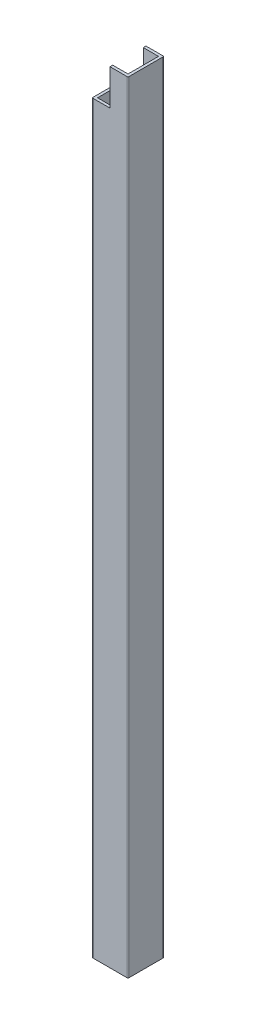
ISO-10303-21;
HEADER;
FILE_DESCRIPTION(('STEP AP214'),'2;1');
FILE_NAME('part.step','',(''),(''),'','','');
FILE_SCHEMA(('AUTOMOTIVE_DESIGN { 1 0 10303 214 1 1 1 1 }'));
ENDSEC;
DATA;
#1=APPLICATION_CONTEXT('core data for automotive mechanical design processes');
#2=APPLICATION_PROTOCOL_DEFINITION('international standard','automotive_design',2000,#1);
#3=PRODUCT_CONTEXT('',#1,'mechanical');
#4=PRODUCT('Part','Part','',(#3));
#5=PRODUCT_RELATED_PRODUCT_CATEGORY('part','',(#4));
#6=PRODUCT_DEFINITION_FORMATION('','',#4);
#7=PRODUCT_DEFINITION_CONTEXT('part definition',#1,'design');
#8=PRODUCT_DEFINITION('design','',#6,#7);
#9=PRODUCT_DEFINITION_SHAPE('','',#8);
#10=(LENGTH_UNIT() NAMED_UNIT(*) SI_UNIT(.MILLI.,.METRE.));
#11=(NAMED_UNIT(*) PLANE_ANGLE_UNIT() SI_UNIT($,.RADIAN.));
#12=(NAMED_UNIT(*) SI_UNIT($,.STERADIAN.) SOLID_ANGLE_UNIT());
#13=UNCERTAINTY_MEASURE_WITH_UNIT(LENGTH_MEASURE(1.E-05),#10,'distance_accuracy_value','');
#14=(GEOMETRIC_REPRESENTATION_CONTEXT(3) GLOBAL_UNCERTAINTY_ASSIGNED_CONTEXT((#13)) GLOBAL_UNIT_ASSIGNED_CONTEXT((#10,
#11,#12)) REPRESENTATION_CONTEXT('',''));
#15=CARTESIAN_POINT('',(0.,0.,0.));
#16=DIRECTION('',(0.,0.,1.));
#17=DIRECTION('',(1.,0.,0.));
#18=AXIS2_PLACEMENT_3D('',#15,#16,#17);
#19=CARTESIAN_POINT('',(0.5,1220.,-19.5));
#20=DIRECTION('',(0.,-1.,0.));
#21=DIRECTION('',(0.,0.,-1.));
#22=AXIS2_PLACEMENT_3D('',#19,#20,#21);
#23=CYLINDRICAL_SURFACE('',#22,0.5);
#24=DIRECTION('',(0.,-1.,0.));
#25=VECTOR('',#24,1.);
#26=CARTESIAN_POINT('',(0.5,1220.,-20.));
#27=LINE('',#26,#25);
#28=CARTESIAN_POINT('',(0.5,1115.,-20.));
#29=VERTEX_POINT('',#28);
#30=CARTESIAN_POINT('',(0.5,905.,-20.));
#31=VERTEX_POINT('',#30);
#32=EDGE_CURVE('E332',#29,#31,#27,.T.);
#33=ORIENTED_EDGE('',*,*,#32,.T.);
#34=CARTESIAN_POINT('',(0.5,905.,-19.5));
#35=DIRECTION('',(0.,1.,0.));
#36=DIRECTION('',(0.,0.,1.));
#37=AXIS2_PLACEMENT_3D('',#34,#35,#36);
#38=CIRCLE('',#37,0.5);
#39=CARTESIAN_POINT('',(0.,905.,-19.5));
#40=VERTEX_POINT('',#39);
#41=EDGE_CURVE('E469',#31,#40,#38,.T.);
#42=ORIENTED_EDGE('',*,*,#41,.T.);
#43=DIRECTION('',(0.,-1.,0.));
#44=VECTOR('',#43,1.);
#45=CARTESIAN_POINT('',(0.,1220.,-19.5));
#46=LINE('',#45,#44);
#47=CARTESIAN_POINT('',(0.,1115.,-19.5));
#48=VERTEX_POINT('',#47);
#49=EDGE_CURVE('E317',#48,#40,#46,.T.);
#50=ORIENTED_EDGE('',*,*,#49,.F.);
#51=CARTESIAN_POINT('',(0.5,1115.,-19.5));
#52=DIRECTION('',(0.,-1.,0.));
#53=DIRECTION('',(0.,0.,-1.));
#54=AXIS2_PLACEMENT_3D('',#51,#52,#53);
#55=CIRCLE('',#54,0.5);
#56=EDGE_CURVE('E543',#48,#29,#55,.T.);
#57=ORIENTED_EDGE('',*,*,#56,.T.);
#58=EDGE_LOOP('',(#33,#42,#50,#57));
#59=FACE_BOUND('',#58,.T.);
#60=ADVANCED_FACE('F39',(#59),#23,.T.);
#61=CARTESIAN_POINT('',(0.5,885.,-20.));
#62=VERTEX_POINT('',#61);
#63=CARTESIAN_POINT('',(0.5,785.,-20.));
#64=VERTEX_POINT('',#63);
#65=EDGE_CURVE('E326',#62,#64,#27,.T.);
#66=ORIENTED_EDGE('',*,*,#65,.T.);
#67=CARTESIAN_POINT('',(0.5,785.,-19.5));
#68=DIRECTION('',(0.,1.,0.));
#69=DIRECTION('',(0.,0.,1.));
#70=AXIS2_PLACEMENT_3D('',#67,#68,#69);
#71=CIRCLE('',#70,0.5);
#72=CARTESIAN_POINT('',(0.,785.,-19.5));
#73=VERTEX_POINT('',#72);
#74=EDGE_CURVE('E294',#64,#73,#71,.T.);
#75=ORIENTED_EDGE('',*,*,#74,.T.);
#76=CARTESIAN_POINT('',(0.,885.,-19.5));
#77=VERTEX_POINT('',#76);
#78=EDGE_CURVE('E305',#77,#73,#46,.T.);
#79=ORIENTED_EDGE('',*,*,#78,.F.);
#80=CARTESIAN_POINT('',(0.5,885.,-19.5));
#81=DIRECTION('',(0.,-1.,0.));
#82=DIRECTION('',(0.,0.,-1.));
#83=AXIS2_PLACEMENT_3D('',#80,#81,#82);
#84=CIRCLE('',#83,0.5);
#85=EDGE_CURVE('E456',#77,#62,#84,.T.);
#86=ORIENTED_EDGE('',*,*,#85,.T.);
#87=EDGE_LOOP('',(#66,#75,#79,#86));
#88=FACE_BOUND('',#87,.T.);
#89=ADVANCED_FACE('F701',(#88),#23,.T.);
#90=CARTESIAN_POINT('',(0.5,1200.,-19.9999999999999));
#91=VERTEX_POINT('',#90);
#92=CARTESIAN_POINT('',(0.5,1135.,-20.));
#93=VERTEX_POINT('',#92);
#94=EDGE_CURVE('E327',#91,#93,#27,.T.);
#95=ORIENTED_EDGE('',*,*,#94,.T.);
#96=CARTESIAN_POINT('',(0.5,1135.,-19.5));
#97=DIRECTION('',(0.,1.,0.));
#98=DIRECTION('',(0.,0.,1.));
#99=AXIS2_PLACEMENT_3D('',#96,#97,#98);
#100=CIRCLE('',#99,0.5);
#101=CARTESIAN_POINT('',(0.,1135.,-19.5));
#102=VERTEX_POINT('',#101);
#103=EDGE_CURVE('E557',#93,#102,#100,.T.);
#104=ORIENTED_EDGE('',*,*,#103,.T.);
#105=CARTESIAN_POINT('',(0.,1200.,-19.5));
#106=VERTEX_POINT('',#105);
#107=EDGE_CURVE('E319',#106,#102,#46,.T.);
#108=ORIENTED_EDGE('',*,*,#107,.F.);
#109=CARTESIAN_POINT('',(0.5,1200.,-19.5));
#110=DIRECTION('',(0.,1.,0.));
#111=DIRECTION('',(0.,0.,1.));
#112=AXIS2_PLACEMENT_3D('',#109,#110,#111);
#113=CIRCLE('',#112,0.5);
#114=EDGE_CURVE('E602',#91,#106,#113,.T.);
#115=ORIENTED_EDGE('',*,*,#114,.F.);
#116=EDGE_LOOP('',(#95,#104,#108,#115));
#117=FACE_BOUND('',#116,.T.);
#118=ADVANCED_FACE('F736',(#117),#23,.T.);
#119=CARTESIAN_POINT('',(0.5,1220.,-20.));
#120=DIRECTION('',(0.,0.,1.));
#121=DIRECTION('',(1.,0.,0.));
#122=AXIS2_PLACEMENT_3D('',#119,#120,#121);
#123=PLANE('',#122);
#124=DIRECTION('',(0.,-1.,0.));
#125=VECTOR('',#124,1.);
#126=CARTESIAN_POINT('',(19.5,1220.,-20.));
#127=LINE('',#126,#125);
#128=CARTESIAN_POINT('',(19.5,1220.,-20.));
#129=VERTEX_POINT('',#128);
#130=CARTESIAN_POINT('',(19.5,785.,-20.));
#131=VERTEX_POINT('',#130);
#132=EDGE_CURVE('E331',#129,#131,#127,.T.);
#133=ORIENTED_EDGE('',*,*,#132,.T.);
#134=DIRECTION('',(1.,0.,0.));
#135=VECTOR('',#134,1.);
#136=CARTESIAN_POINT('',(20.,785.,-20.));
#137=LINE('',#136,#135);
#138=EDGE_CURVE('E55',#64,#131,#137,.T.);
#139=ORIENTED_EDGE('',*,*,#138,.F.);
#140=ORIENTED_EDGE('',*,*,#65,.F.);
#141=DIRECTION('',(-1.,0.,0.));
#142=VECTOR('',#141,1.);
#143=CARTESIAN_POINT('',(15.,885.,-20.));
#144=LINE('',#143,#142);
#145=CARTESIAN_POINT('',(15.,885.,-20.));
#146=VERTEX_POINT('',#145);
#147=EDGE_CURVE('E410',#146,#62,#144,.T.);
#148=ORIENTED_EDGE('',*,*,#147,.F.);
#149=DIRECTION('',(0.,-1.,0.));
#150=VECTOR('',#149,1.);
#151=CARTESIAN_POINT('',(15.,905.,-20.));
#152=LINE('',#151,#150);
#153=CARTESIAN_POINT('',(15.,905.,-20.));
#154=VERTEX_POINT('',#153);
#155=EDGE_CURVE('E430',#154,#146,#152,.T.);
#156=ORIENTED_EDGE('',*,*,#155,.F.);
#157=DIRECTION('',(1.,0.,0.));
#158=VECTOR('',#157,1.);
#159=CARTESIAN_POINT('',(0.,905.,-20.));
#160=LINE('',#159,#158);
#161=EDGE_CURVE('E404',#31,#154,#160,.T.);
#162=ORIENTED_EDGE('',*,*,#161,.F.);
#163=ORIENTED_EDGE('',*,*,#32,.F.);
#164=DIRECTION('',(-1.,0.,0.));
#165=VECTOR('',#164,1.);
#166=CARTESIAN_POINT('',(15.,1115.,-20.));
#167=LINE('',#166,#165);
#168=CARTESIAN_POINT('',(15.,1115.,-20.));
#169=VERTEX_POINT('',#168);
#170=EDGE_CURVE('E514',#169,#29,#167,.T.);
#171=ORIENTED_EDGE('',*,*,#170,.F.);
#172=DIRECTION('',(0.,-1.,0.));
#173=VECTOR('',#172,1.);
#174=CARTESIAN_POINT('',(15.,1135.,-20.));
#175=LINE('',#174,#173);
#176=CARTESIAN_POINT('',(15.,1135.,-20.));
#177=VERTEX_POINT('',#176);
#178=EDGE_CURVE('E486',#177,#169,#175,.T.);
#179=ORIENTED_EDGE('',*,*,#178,.F.);
#180=DIRECTION('',(1.,0.,0.));
#181=VECTOR('',#180,1.);
#182=CARTESIAN_POINT('',(0.,1135.,-20.));
#183=LINE('',#182,#181);
#184=EDGE_CURVE('E491',#93,#177,#183,.T.);
#185=ORIENTED_EDGE('',*,*,#184,.F.);
#186=ORIENTED_EDGE('',*,*,#94,.F.);
#187=DIRECTION('',(-1.,0.,0.));
#188=VECTOR('',#187,1.);
#189=CARTESIAN_POINT('',(10.,1200.,-19.9999999999999));
#190=LINE('',#189,#188);
#191=CARTESIAN_POINT('',(10.,1200.,-19.9999999999999));
#192=VERTEX_POINT('',#191);
#193=EDGE_CURVE('E580',#192,#91,#190,.T.);
#194=ORIENTED_EDGE('',*,*,#193,.F.);
#195=DIRECTION('',(0.,1.,0.));
#196=VECTOR('',#195,1.);
#197=CARTESIAN_POINT('',(10.,1220.,-20.));
#198=LINE('',#197,#196);
#199=CARTESIAN_POINT('',(10.,1220.,-20.));
#200=VERTEX_POINT('',#199);
#201=EDGE_CURVE('E571',#192,#200,#198,.T.);
#202=ORIENTED_EDGE('',*,*,#201,.T.);
#203=DIRECTION('',(-1.,0.,0.));
#204=VECTOR('',#203,1.);
#205=CARTESIAN_POINT('',(0.5,1220.,-20.));
#206=LINE('',#205,#204);
#207=EDGE_CURVE('E644',#129,#200,#206,.T.);
#208=ORIENTED_EDGE('',*,*,#207,.F.);
#209=EDGE_LOOP('',(#133,#139,#140,#148,#156,#162,#163,#171,#179,#185,#186,#194,#202,#208));
#210=FACE_BOUND('',#209,.T.);
#211=ADVANCED_FACE('F704',(#210),#123,.F.);
#212=CARTESIAN_POINT('',(0.,1220.,-0.500000000000004));
#213=DIRECTION('',(1.,0.,0.));
#214=DIRECTION('',(0.,0.,-1.));
#215=AXIS2_PLACEMENT_3D('',#212,#213,#214);
#216=PLANE('',#215);
#217=ORIENTED_EDGE('',*,*,#78,.T.);
#218=DIRECTION('',(0.,0.,-1.));
#219=VECTOR('',#218,1.);
#220=CARTESIAN_POINT('',(0.,785.,0.));
#221=LINE('',#220,#219);
#222=CARTESIAN_POINT('',(0.,785.,-0.5));
#223=VERTEX_POINT('',#222);
#224=EDGE_CURVE('E285',#223,#73,#221,.T.);
#225=ORIENTED_EDGE('',*,*,#224,.F.);
#226=DIRECTION('',(0.,-1.,0.));
#227=VECTOR('',#226,1.);
#228=CARTESIAN_POINT('',(0.,1220.,-0.500000000000003));
#229=LINE('',#228,#227);
#230=CARTESIAN_POINT('',(0.,1200.,-0.5));
#231=VERTEX_POINT('',#230);
#232=EDGE_CURVE('E302',#231,#223,#229,.T.);
#233=ORIENTED_EDGE('',*,*,#232,.F.);
#234=DIRECTION('',(0.,0.,-1.));
#235=VECTOR('',#234,1.);
#236=CARTESIAN_POINT('',(0.,1200.,0.));
#237=LINE('',#236,#235);
#238=EDGE_CURVE('E561',#231,#106,#237,.T.);
#239=ORIENTED_EDGE('',*,*,#238,.T.);
#240=ORIENTED_EDGE('',*,*,#107,.T.);
#241=DIRECTION('',(0.,0.,-1.));
#242=VECTOR('',#241,1.);
#243=CARTESIAN_POINT('',(0.,1135.,-5.));
#244=LINE('',#243,#242);
#245=CARTESIAN_POINT('',(0.,1135.,-5.));
#246=VERTEX_POINT('',#245);
#247=EDGE_CURVE('E524',#246,#102,#244,.T.);
#248=ORIENTED_EDGE('',*,*,#247,.F.);
#249=DIRECTION('',(0.,1.,0.));
#250=VECTOR('',#249,1.);
#251=CARTESIAN_POINT('',(0.,1130.,-5.));
#252=LINE('',#251,#250);
#253=CARTESIAN_POINT('',(0.,1130.,-5.));
#254=VERTEX_POINT('',#253);
#255=EDGE_CURVE('E503',#254,#246,#252,.T.);
#256=ORIENTED_EDGE('',*,*,#255,.F.);
#257=DIRECTION('',(0.,0.,-1.));
#258=VECTOR('',#257,1.);
#259=CARTESIAN_POINT('',(0.,1130.,-5.));
#260=LINE('',#259,#258);
#261=CARTESIAN_POINT('',(0.,1130.,-17.));
#262=VERTEX_POINT('',#261);
#263=EDGE_CURVE('E527',#254,#262,#260,.T.);
#264=ORIENTED_EDGE('',*,*,#263,.T.);
#265=DIRECTION('',(0.,1.,0.));
#266=VECTOR('',#265,1.);
#267=CARTESIAN_POINT('',(0.,1130.,-17.));
#268=LINE('',#267,#266);
#269=CARTESIAN_POINT('',(0.,1120.,-17.));
#270=VERTEX_POINT('',#269);
#271=EDGE_CURVE('E473',#270,#262,#268,.T.);
#272=ORIENTED_EDGE('',*,*,#271,.F.);
#273=DIRECTION('',(0.,0.,-1.));
#274=VECTOR('',#273,1.);
#275=CARTESIAN_POINT('',(0.,1120.,-5.));
#276=LINE('',#275,#274);
#277=CARTESIAN_POINT('',(0.,1120.,-5.));
#278=VERTEX_POINT('',#277);
#279=EDGE_CURVE('E531',#278,#270,#276,.T.);
#280=ORIENTED_EDGE('',*,*,#279,.F.);
#281=DIRECTION('',(0.,1.,0.));
#282=VECTOR('',#281,1.);
#283=CARTESIAN_POINT('',(0.,1115.,-5.));
#284=LINE('',#283,#282);
#285=CARTESIAN_POINT('',(0.,1115.,-5.));
#286=VERTEX_POINT('',#285);
#287=EDGE_CURVE('E490',#286,#278,#284,.T.);
#288=ORIENTED_EDGE('',*,*,#287,.F.);
#289=DIRECTION('',(0.,0.,-1.));
#290=VECTOR('',#289,1.);
#291=CARTESIAN_POINT('',(0.,1115.,-5.));
#292=LINE('',#291,#290);
#293=EDGE_CURVE('E535',#286,#48,#292,.T.);
#294=ORIENTED_EDGE('',*,*,#293,.T.);
#295=ORIENTED_EDGE('',*,*,#49,.T.);
#296=DIRECTION('',(0.,0.,-1.));
#297=VECTOR('',#296,1.);
#298=CARTESIAN_POINT('',(0.,905.,-5.));
#299=LINE('',#298,#297);
#300=CARTESIAN_POINT('',(0.,905.,-5.));
#301=VERTEX_POINT('',#300);
#302=EDGE_CURVE('E439',#301,#40,#299,.T.);
#303=ORIENTED_EDGE('',*,*,#302,.F.);
#304=DIRECTION('',(0.,1.,0.));
#305=VECTOR('',#304,1.);
#306=CARTESIAN_POINT('',(0.,900.,-5.));
#307=LINE('',#306,#305);
#308=CARTESIAN_POINT('',(0.,900.,-5.));
#309=VERTEX_POINT('',#308);
#310=EDGE_CURVE('E422',#309,#301,#307,.T.);
#311=ORIENTED_EDGE('',*,*,#310,.F.);
#312=DIRECTION('',(0.,0.,-1.));
#313=VECTOR('',#312,1.);
#314=CARTESIAN_POINT('',(0.,900.,-5.));
#315=LINE('',#314,#313);
#316=CARTESIAN_POINT('',(0.,900.,-17.));
#317=VERTEX_POINT('',#316);
#318=EDGE_CURVE('E442',#309,#317,#315,.T.);
#319=ORIENTED_EDGE('',*,*,#318,.T.);
#320=DIRECTION('',(0.,1.,0.));
#321=VECTOR('',#320,1.);
#322=CARTESIAN_POINT('',(0.,900.,-17.));
#323=LINE('',#322,#321);
#324=CARTESIAN_POINT('',(0.,890.,-17.));
#325=VERTEX_POINT('',#324);
#326=EDGE_CURVE('E683',#325,#317,#323,.T.);
#327=ORIENTED_EDGE('',*,*,#326,.F.);
#328=DIRECTION('',(0.,0.,-1.));
#329=VECTOR('',#328,1.);
#330=CARTESIAN_POINT('',(0.,890.,-5.));
#331=LINE('',#330,#329);
#332=CARTESIAN_POINT('',(0.,890.,-5.));
#333=VERTEX_POINT('',#332);
#334=EDGE_CURVE('E446',#333,#325,#331,.T.);
#335=ORIENTED_EDGE('',*,*,#334,.F.);
#336=DIRECTION('',(0.,1.,0.));
#337=VECTOR('',#336,1.);
#338=CARTESIAN_POINT('',(0.,885.,-5.));
#339=LINE('',#338,#337);
#340=CARTESIAN_POINT('',(0.,885.,-5.));
#341=VERTEX_POINT('',#340);
#342=EDGE_CURVE('E403',#341,#333,#339,.T.);
#343=ORIENTED_EDGE('',*,*,#342,.F.);
#344=DIRECTION('',(0.,0.,-1.));
#345=VECTOR('',#344,1.);
#346=CARTESIAN_POINT('',(0.,885.,-5.));
#347=LINE('',#346,#345);
#348=EDGE_CURVE('E400',#341,#77,#347,.T.);
#349=ORIENTED_EDGE('',*,*,#348,.T.);
#350=EDGE_LOOP('',(#217,#225,#233,#239,#240,#248,#256,#264,#272,#280,#288,#294,#295,#303,#311,
#319,#327,#335,#343,#349));
#351=FACE_BOUND('',#350,.T.);
#352=ADVANCED_FACE('F300',(#351),#216,.F.);
#353=CARTESIAN_POINT('',(0.5,1220.,-0.5));
#354=DIRECTION('',(0.,-1.,0.));
#355=DIRECTION('',(0.,0.,-1.));
#356=AXIS2_PLACEMENT_3D('',#353,#354,#355);
#357=CYLINDRICAL_SURFACE('',#356,0.5);
#358=ORIENTED_EDGE('',*,*,#232,.T.);
#359=CARTESIAN_POINT('',(0.5,785.,-0.5));
#360=DIRECTION('',(0.,1.,0.));
#361=DIRECTION('',(0.,0.,1.));
#362=AXIS2_PLACEMENT_3D('',#359,#360,#361);
#363=CIRCLE('',#362,0.5);
#364=CARTESIAN_POINT('',(0.500000000000004,785.,0.));
#365=VERTEX_POINT('',#364);
#366=EDGE_CURVE('E282',#223,#365,#363,.T.);
#367=ORIENTED_EDGE('',*,*,#366,.T.);
#368=DIRECTION('',(0.,-1.,0.));
#369=VECTOR('',#368,1.);
#370=CARTESIAN_POINT('',(0.500000000000004,1220.,0.));
#371=LINE('',#370,#369);
#372=CARTESIAN_POINT('',(0.500000000000004,1200.,0.));
#373=VERTEX_POINT('',#372);
#374=EDGE_CURVE('E313',#373,#365,#371,.T.);
#375=ORIENTED_EDGE('',*,*,#374,.F.);
#376=CARTESIAN_POINT('',(0.5,1200.,-0.5));
#377=DIRECTION('',(0.,1.,0.));
#378=DIRECTION('',(0.,0.,1.));
#379=AXIS2_PLACEMENT_3D('',#376,#377,#378);
#380=CIRCLE('',#379,0.5);
#381=EDGE_CURVE('E311',#231,#373,#380,.T.);
#382=ORIENTED_EDGE('',*,*,#381,.F.);
#383=EDGE_LOOP('',(#358,#367,#375,#382));
#384=FACE_BOUND('',#383,.T.);
#385=ADVANCED_FACE('F310',(#384),#357,.T.);
#386=CARTESIAN_POINT('',(0.500000000000004,1220.,0.));
#387=DIRECTION('',(0.,0.,-1.));
#388=DIRECTION('',(-1.,0.,0.));
#389=AXIS2_PLACEMENT_3D('',#386,#387,#388);
#390=PLANE('',#389);
#391=ORIENTED_EDGE('',*,*,#374,.T.);
#392=DIRECTION('',(1.,0.,0.));
#393=VECTOR('',#392,1.);
#394=CARTESIAN_POINT('',(20.,785.,0.));
#395=LINE('',#394,#393);
#396=CARTESIAN_POINT('',(19.5,785.,0.));
#397=VERTEX_POINT('',#396);
#398=EDGE_CURVE('E288',#365,#397,#395,.T.);
#399=ORIENTED_EDGE('',*,*,#398,.T.);
#400=DIRECTION('',(0.,-1.,0.));
#401=VECTOR('',#400,1.);
#402=CARTESIAN_POINT('',(19.5,1220.,0.));
#403=LINE('',#402,#401);
#404=CARTESIAN_POINT('',(19.5,1220.,0.));
#405=VERTEX_POINT('',#404);
#406=EDGE_CURVE('E320',#405,#397,#403,.T.);
#407=ORIENTED_EDGE('',*,*,#406,.F.);
#408=DIRECTION('',(1.,0.,0.));
#409=VECTOR('',#408,1.);
#410=CARTESIAN_POINT('',(0.500000000000004,1220.,0.));
#411=LINE('',#410,#409);
#412=CARTESIAN_POINT('',(10.,1220.,0.));
#413=VERTEX_POINT('',#412);
#414=EDGE_CURVE('E648',#413,#405,#411,.T.);
#415=ORIENTED_EDGE('',*,*,#414,.F.);
#416=DIRECTION('',(0.,-1.,0.));
#417=VECTOR('',#416,1.);
#418=CARTESIAN_POINT('',(10.,1220.,0.));
#419=LINE('',#418,#417);
#420=CARTESIAN_POINT('',(10.,1200.,0.));
#421=VERTEX_POINT('',#420);
#422=EDGE_CURVE('E562',#413,#421,#419,.T.);
#423=ORIENTED_EDGE('',*,*,#422,.T.);
#424=DIRECTION('',(-1.,0.,0.));
#425=VECTOR('',#424,1.);
#426=CARTESIAN_POINT('',(10.,1200.,0.));
#427=LINE('',#426,#425);
#428=EDGE_CURVE('E585',#421,#373,#427,.T.);
#429=ORIENTED_EDGE('',*,*,#428,.T.);
#430=EDGE_LOOP('',(#391,#399,#407,#415,#423,#429));
#431=FACE_BOUND('',#430,.T.);
#432=ADVANCED_FACE('F659',(#431),#390,.F.);
#433=CARTESIAN_POINT('',(1.5,1220.,-1.5));
#434=DIRECTION('',(1.,0.,0.));
#435=DIRECTION('',(0.,0.,-1.));
#436=AXIS2_PLACEMENT_3D('',#433,#434,#435);
#437=PLANE('',#436);
#438=DIRECTION('',(0.,0.,1.));
#439=VECTOR('',#438,1.);
#440=CARTESIAN_POINT('',(1.5,785.,-1.5));
#441=LINE('',#440,#439);
#442=CARTESIAN_POINT('',(1.5,785.,-18.5));
#443=VERTEX_POINT('',#442);
#444=CARTESIAN_POINT('',(1.5,785.,-1.5));
#445=VERTEX_POINT('',#444);
#446=EDGE_CURVE('E673',#443,#445,#441,.T.);
#447=ORIENTED_EDGE('',*,*,#446,.F.);
#448=DIRECTION('',(0.,-1.,0.));
#449=VECTOR('',#448,1.);
#450=CARTESIAN_POINT('',(1.5,1220.,-18.5));
#451=LINE('',#450,#449);
#452=CARTESIAN_POINT('',(1.5,885.,-18.5));
#453=VERTEX_POINT('',#452);
#454=EDGE_CURVE('E616',#453,#443,#451,.T.);
#455=ORIENTED_EDGE('',*,*,#454,.F.);
#456=DIRECTION('',(0.,0.,-1.));
#457=VECTOR('',#456,1.);
#458=CARTESIAN_POINT('',(1.5,885.,-1.5));
#459=LINE('',#458,#457);
#460=CARTESIAN_POINT('',(1.5,885.,-5.));
#461=VERTEX_POINT('',#460);
#462=EDGE_CURVE('E388',#461,#453,#459,.T.);
#463=ORIENTED_EDGE('',*,*,#462,.F.);
#464=DIRECTION('',(0.,1.,0.));
#465=VECTOR('',#464,1.);
#466=CARTESIAN_POINT('',(1.5,1220.,-5.));
#467=LINE('',#466,#465);
#468=CARTESIAN_POINT('',(1.5,890.,-5.));
#469=VERTEX_POINT('',#468);
#470=EDGE_CURVE('E48',#461,#469,#467,.T.);
#471=ORIENTED_EDGE('',*,*,#470,.T.);
#472=DIRECTION('',(0.,0.,1.));
#473=VECTOR('',#472,1.);
#474=CARTESIAN_POINT('',(1.5,890.,-1.5));
#475=LINE('',#474,#473);
#476=CARTESIAN_POINT('',(1.5,890.,-17.));
#477=VERTEX_POINT('',#476);
#478=EDGE_CURVE('E386',#477,#469,#475,.T.);
#479=ORIENTED_EDGE('',*,*,#478,.F.);
#480=DIRECTION('',(0.,-1.,0.));
#481=VECTOR('',#480,1.);
#482=CARTESIAN_POINT('',(1.5,1220.,-17.));
#483=LINE('',#482,#481);
#484=CARTESIAN_POINT('',(1.5,900.,-17.));
#485=VERTEX_POINT('',#484);
#486=EDGE_CURVE('E413',#485,#477,#483,.T.);
#487=ORIENTED_EDGE('',*,*,#486,.F.);
#488=DIRECTION('',(0.,0.,-1.));
#489=VECTOR('',#488,1.);
#490=CARTESIAN_POINT('',(1.5,900.,-1.5));
#491=LINE('',#490,#489);
#492=CARTESIAN_POINT('',(1.5,900.,-5.));
#493=VERTEX_POINT('',#492);
#494=EDGE_CURVE('E462',#493,#485,#491,.T.);
#495=ORIENTED_EDGE('',*,*,#494,.F.);
#496=CARTESIAN_POINT('',(1.5,905.,-5.));
#497=VERTEX_POINT('',#496);
#498=EDGE_CURVE('E373',#493,#497,#467,.T.);
#499=ORIENTED_EDGE('',*,*,#498,.T.);
#500=DIRECTION('',(0.,0.,1.));
#501=VECTOR('',#500,1.);
#502=CARTESIAN_POINT('',(1.5,905.,-1.5));
#503=LINE('',#502,#501);
#504=CARTESIAN_POINT('',(1.5,905.,-18.5));
#505=VERTEX_POINT('',#504);
#506=EDGE_CURVE('E466',#505,#497,#503,.T.);
#507=ORIENTED_EDGE('',*,*,#506,.F.);
#508=CARTESIAN_POINT('',(1.5,1115.,-18.5));
#509=VERTEX_POINT('',#508);
#510=EDGE_CURVE('E622',#509,#505,#451,.T.);
#511=ORIENTED_EDGE('',*,*,#510,.F.);
#512=DIRECTION('',(0.,0.,-1.));
#513=VECTOR('',#512,1.);
#514=CARTESIAN_POINT('',(1.5,1115.,-1.5));
#515=LINE('',#514,#513);
#516=CARTESIAN_POINT('',(1.5,1115.,-5.));
#517=VERTEX_POINT('',#516);
#518=EDGE_CURVE('E523',#517,#509,#515,.T.);
#519=ORIENTED_EDGE('',*,*,#518,.F.);
#520=DIRECTION('',(0.,1.,0.));
#521=VECTOR('',#520,1.);
#522=CARTESIAN_POINT('',(1.5,1220.,-5.));
#523=LINE('',#522,#521);
#524=CARTESIAN_POINT('',(1.5,1120.,-5.));
#525=VERTEX_POINT('',#524);
#526=EDGE_CURVE('E364',#517,#525,#523,.T.);
#527=ORIENTED_EDGE('',*,*,#526,.T.);
#528=DIRECTION('',(0.,0.,1.));
#529=VECTOR('',#528,1.);
#530=CARTESIAN_POINT('',(1.5,1120.,-1.5));
#531=LINE('',#530,#529);
#532=CARTESIAN_POINT('',(1.5,1120.,-17.));
#533=VERTEX_POINT('',#532);
#534=EDGE_CURVE('E547',#533,#525,#531,.T.);
#535=ORIENTED_EDGE('',*,*,#534,.F.);
#536=DIRECTION('',(0.,-1.,0.));
#537=VECTOR('',#536,1.);
#538=CARTESIAN_POINT('',(1.5,1220.,-17.));
#539=LINE('',#538,#537);
#540=CARTESIAN_POINT('',(1.5,1130.,-17.));
#541=VERTEX_POINT('',#540);
#542=EDGE_CURVE('E481',#541,#533,#539,.T.);
#543=ORIENTED_EDGE('',*,*,#542,.F.);
#544=DIRECTION('',(0.,0.,-1.));
#545=VECTOR('',#544,1.);
#546=CARTESIAN_POINT('',(1.5,1130.,-1.5));
#547=LINE('',#546,#545);
#548=CARTESIAN_POINT('',(1.5,1130.,-5.));
#549=VERTEX_POINT('',#548);
#550=EDGE_CURVE('E550',#549,#541,#547,.T.);
#551=ORIENTED_EDGE('',*,*,#550,.F.);
#552=CARTESIAN_POINT('',(1.5,1135.,-5.));
#553=VERTEX_POINT('',#552);
#554=EDGE_CURVE('E360',#549,#553,#523,.T.);
#555=ORIENTED_EDGE('',*,*,#554,.T.);
#556=DIRECTION('',(0.,0.,1.));
#557=VECTOR('',#556,1.);
#558=CARTESIAN_POINT('',(1.5,1135.,-1.5));
#559=LINE('',#558,#557);
#560=CARTESIAN_POINT('',(1.5,1135.,-18.5));
#561=VERTEX_POINT('',#560);
#562=EDGE_CURVE('E554',#561,#553,#559,.T.);
#563=ORIENTED_EDGE('',*,*,#562,.F.);
#564=CARTESIAN_POINT('',(1.5,1200.,-18.5));
#565=VERTEX_POINT('',#564);
#566=EDGE_CURVE('E617',#565,#561,#451,.T.);
#567=ORIENTED_EDGE('',*,*,#566,.F.);
#568=DIRECTION('',(0.,0.,1.));
#569=VECTOR('',#568,1.);
#570=CARTESIAN_POINT('',(1.5,1200.,-1.5));
#571=LINE('',#570,#569);
#572=CARTESIAN_POINT('',(1.5,1200.,-1.5));
#573=VERTEX_POINT('',#572);
#574=EDGE_CURVE('E592',#565,#573,#571,.T.);
#575=ORIENTED_EDGE('',*,*,#574,.T.);
#576=DIRECTION('',(0.,-1.,0.));
#577=VECTOR('',#576,1.);
#578=CARTESIAN_POINT('',(1.5,1220.,-1.5));
#579=LINE('',#578,#577);
#580=EDGE_CURVE('E630',#573,#445,#579,.T.);
#581=ORIENTED_EDGE('',*,*,#580,.T.);
#582=EDGE_LOOP('',(#447,#455,#463,#471,#479,#487,#495,#499,#507,#511,#519,#527,#535,#543,#551,
#555,#563,#567,#575,#581));
#583=FACE_BOUND('',#582,.T.);
#584=ADVANCED_FACE('F384',(#583),#437,.T.);
#585=CARTESIAN_POINT('',(1.5,1220.,-1.5));
#586=DIRECTION('',(0.,0.,-1.));
#587=DIRECTION('',(-1.,0.,0.));
#588=AXIS2_PLACEMENT_3D('',#585,#586,#587);
#589=PLANE('',#588);
#590=DIRECTION('',(1.,0.,0.));
#591=VECTOR('',#590,1.);
#592=CARTESIAN_POINT('',(1.5,785.,-1.5));
#593=LINE('',#592,#591);
#594=CARTESIAN_POINT('',(18.5,785.,-1.5));
#595=VERTEX_POINT('',#594);
#596=EDGE_CURVE('E62',#445,#595,#593,.T.);
#597=ORIENTED_EDGE('',*,*,#596,.F.);
#598=ORIENTED_EDGE('',*,*,#580,.F.);
#599=DIRECTION('',(1.,0.,0.));
#600=VECTOR('',#599,1.);
#601=CARTESIAN_POINT('',(1.5,1200.,-1.5));
#602=LINE('',#601,#600);
#603=CARTESIAN_POINT('',(10.,1200.,-1.5));
#604=VERTEX_POINT('',#603);
#605=EDGE_CURVE('E596',#573,#604,#602,.T.);
#606=ORIENTED_EDGE('',*,*,#605,.T.);
#607=DIRECTION('',(0.,-1.,0.));
#608=VECTOR('',#607,1.);
#609=CARTESIAN_POINT('',(10.,1220.,-1.5));
#610=LINE('',#609,#608);
#611=CARTESIAN_POINT('',(10.,1220.,-1.5));
#612=VERTEX_POINT('',#611);
#613=EDGE_CURVE('E589',#612,#604,#610,.T.);
#614=ORIENTED_EDGE('',*,*,#613,.F.);
#615=DIRECTION('',(1.,0.,0.));
#616=VECTOR('',#615,1.);
#617=CARTESIAN_POINT('',(1.5,1220.,-1.5));
#618=LINE('',#617,#616);
#619=CARTESIAN_POINT('',(18.5,1220.,-1.5));
#620=VERTEX_POINT('',#619);
#621=EDGE_CURVE('E605',#612,#620,#618,.T.);
#622=ORIENTED_EDGE('',*,*,#621,.T.);
#623=DIRECTION('',(0.,-1.,0.));
#624=VECTOR('',#623,1.);
#625=CARTESIAN_POINT('',(18.5,1220.,-1.5));
#626=LINE('',#625,#624);
#627=EDGE_CURVE('E626',#620,#595,#626,.T.);
#628=ORIENTED_EDGE('',*,*,#627,.T.);
#629=EDGE_LOOP('',(#597,#598,#606,#614,#622,#628));
#630=FACE_BOUND('',#629,.T.);
#631=ADVANCED_FACE('F794',(#630),#589,.T.);
#632=CARTESIAN_POINT('',(1.5,1220.,-18.5));
#633=DIRECTION('',(0.,0.,1.));
#634=DIRECTION('',(1.,0.,0.));
#635=AXIS2_PLACEMENT_3D('',#632,#633,#634);
#636=PLANE('',#635);
#637=DIRECTION('',(-1.,0.,0.));
#638=VECTOR('',#637,1.);
#639=CARTESIAN_POINT('',(1.5,785.,-18.5));
#640=LINE('',#639,#638);
#641=CARTESIAN_POINT('',(18.5,785.,-18.5));
#642=VERTEX_POINT('',#641);
#643=EDGE_CURVE('E667',#642,#443,#640,.T.);
#644=ORIENTED_EDGE('',*,*,#643,.F.);
#645=DIRECTION('',(0.,-1.,0.));
#646=VECTOR('',#645,1.);
#647=CARTESIAN_POINT('',(18.5,1220.,-18.5));
#648=LINE('',#647,#646);
#649=CARTESIAN_POINT('',(18.5,1220.,-18.5));
#650=VERTEX_POINT('',#649);
#651=EDGE_CURVE('E621',#650,#642,#648,.T.);
#652=ORIENTED_EDGE('',*,*,#651,.F.);
#653=DIRECTION('',(-1.,0.,0.));
#654=VECTOR('',#653,1.);
#655=CARTESIAN_POINT('',(1.5,1220.,-18.5));
#656=LINE('',#655,#654);
#657=CARTESIAN_POINT('',(10.,1220.,-18.5));
#658=VERTEX_POINT('',#657);
#659=EDGE_CURVE('E612',#650,#658,#656,.T.);
#660=ORIENTED_EDGE('',*,*,#659,.T.);
#661=DIRECTION('',(0.,1.,0.));
#662=VECTOR('',#661,1.);
#663=CARTESIAN_POINT('',(10.,1220.,-18.5));
#664=LINE('',#663,#662);
#665=CARTESIAN_POINT('',(10.,1200.,-18.5));
#666=VERTEX_POINT('',#665);
#667=EDGE_CURVE('E344',#666,#658,#664,.T.);
#668=ORIENTED_EDGE('',*,*,#667,.F.);
#669=DIRECTION('',(-1.,0.,0.));
#670=VECTOR('',#669,1.);
#671=CARTESIAN_POINT('',(1.5,1200.,-18.5));
#672=LINE('',#671,#670);
#673=EDGE_CURVE('E347',#666,#565,#672,.T.);
#674=ORIENTED_EDGE('',*,*,#673,.T.);
#675=ORIENTED_EDGE('',*,*,#566,.T.);
#676=DIRECTION('',(-1.,0.,0.));
#677=VECTOR('',#676,1.);
#678=CARTESIAN_POINT('',(1.5,1135.,-18.5));
#679=LINE('',#678,#677);
#680=CARTESIAN_POINT('',(15.,1135.,-18.5));
#681=VERTEX_POINT('',#680);
#682=EDGE_CURVE('E357',#681,#561,#679,.T.);
#683=ORIENTED_EDGE('',*,*,#682,.F.);
#684=DIRECTION('',(0.,1.,0.));
#685=VECTOR('',#684,1.);
#686=CARTESIAN_POINT('',(15.,1220.,-18.5));
#687=LINE('',#686,#685);
#688=CARTESIAN_POINT('',(15.,1115.,-18.5));
#689=VERTEX_POINT('',#688);
#690=EDGE_CURVE('E354',#689,#681,#687,.T.);
#691=ORIENTED_EDGE('',*,*,#690,.F.);
#692=DIRECTION('',(1.,0.,0.));
#693=VECTOR('',#692,1.);
#694=CARTESIAN_POINT('',(1.5,1115.,-18.5));
#695=LINE('',#694,#693);
#696=EDGE_CURVE('E351',#509,#689,#695,.T.);
#697=ORIENTED_EDGE('',*,*,#696,.F.);
#698=ORIENTED_EDGE('',*,*,#510,.T.);
#699=DIRECTION('',(-1.,0.,0.));
#700=VECTOR('',#699,1.);
#701=CARTESIAN_POINT('',(1.5,905.,-18.5));
#702=LINE('',#701,#700);
#703=CARTESIAN_POINT('',(15.,905.,-18.5));
#704=VERTEX_POINT('',#703);
#705=EDGE_CURVE('E371',#704,#505,#702,.T.);
#706=ORIENTED_EDGE('',*,*,#705,.F.);
#707=DIRECTION('',(0.,1.,0.));
#708=VECTOR('',#707,1.);
#709=CARTESIAN_POINT('',(15.,1220.,-18.5));
#710=LINE('',#709,#708);
#711=CARTESIAN_POINT('',(15.,885.,-18.5));
#712=VERTEX_POINT('',#711);
#713=EDGE_CURVE('E368',#712,#704,#710,.T.);
#714=ORIENTED_EDGE('',*,*,#713,.F.);
#715=DIRECTION('',(1.,0.,0.));
#716=VECTOR('',#715,1.);
#717=CARTESIAN_POINT('',(1.5,885.,-18.5));
#718=LINE('',#717,#716);
#719=EDGE_CURVE('E365',#453,#712,#718,.T.);
#720=ORIENTED_EDGE('',*,*,#719,.F.);
#721=ORIENTED_EDGE('',*,*,#454,.T.);
#722=EDGE_LOOP('',(#644,#652,#660,#668,#674,#675,#683,#691,#697,#698,#706,#714,#720,#721));
#723=FACE_BOUND('',#722,.T.);
#724=ADVANCED_FACE('F785',(#723),#636,.T.);
#725=CARTESIAN_POINT('',(19.5,1220.,-0.5));
#726=DIRECTION('',(0.,1.,0.));
#727=DIRECTION('',(0.,0.,1.));
#728=AXIS2_PLACEMENT_3D('',#725,#726,#727);
#729=PLANE('',#728);
#730=DIRECTION('',(0.,0.,1.));
#731=VECTOR('',#730,1.);
#732=CARTESIAN_POINT('',(10.,1220.,0.));
#733=LINE('',#732,#731);
#734=EDGE_CURVE('E575',#612,#413,#733,.T.);
#735=ORIENTED_EDGE('',*,*,#734,.T.);
#736=ORIENTED_EDGE('',*,*,#414,.T.);
#737=CARTESIAN_POINT('',(19.5,1220.,-0.5));
#738=DIRECTION('',(0.,1.,0.));
#739=DIRECTION('',(0.,0.,1.));
#740=AXIS2_PLACEMENT_3D('',#737,#738,#739);
#741=CIRCLE('',#740,0.5);
#742=CARTESIAN_POINT('',(20.,1220.,-0.5));
#743=VERTEX_POINT('',#742);
#744=EDGE_CURVE('E634',#405,#743,#741,.T.);
#745=ORIENTED_EDGE('',*,*,#744,.T.);
#746=DIRECTION('',(0.,0.,-1.));
#747=VECTOR('',#746,1.);
#748=CARTESIAN_POINT('',(20.,1220.,-0.5));
#749=LINE('',#748,#747);
#750=CARTESIAN_POINT('',(20.,1220.,-19.5));
#751=VERTEX_POINT('',#750);
#752=EDGE_CURVE('E638',#743,#751,#749,.T.);
#753=ORIENTED_EDGE('',*,*,#752,.T.);
#754=CARTESIAN_POINT('',(19.5,1220.,-19.5));
#755=DIRECTION('',(0.,1.,0.));
#756=DIRECTION('',(0.,0.,-1.));
#757=AXIS2_PLACEMENT_3D('',#754,#755,#756);
#758=CIRCLE('',#757,0.5);
#759=EDGE_CURVE('E641',#751,#129,#758,.T.);
#760=ORIENTED_EDGE('',*,*,#759,.T.);
#761=ORIENTED_EDGE('',*,*,#207,.T.);
#762=EDGE_CURVE('E576',#200,#658,#733,.T.);
#763=ORIENTED_EDGE('',*,*,#762,.T.);
#764=ORIENTED_EDGE('',*,*,#659,.F.);
#765=DIRECTION('',(0.,0.,-1.));
#766=VECTOR('',#765,1.);
#767=CARTESIAN_POINT('',(18.5,1220.,-1.5));
#768=LINE('',#767,#766);
#769=EDGE_CURVE('E608',#620,#650,#768,.T.);
#770=ORIENTED_EDGE('',*,*,#769,.F.);
#771=ORIENTED_EDGE('',*,*,#621,.F.);
#772=EDGE_LOOP('',(#735,#736,#745,#753,#760,#761,#763,#764,#770,#771));
#773=FACE_BOUND('',#772,.T.);
#774=ADVANCED_FACE('F716',(#773),#729,.T.);
#775=CARTESIAN_POINT('',(19.5,1220.,-0.5));
#776=DIRECTION('',(0.,-1.,0.));
#777=DIRECTION('',(0.,0.,-1.));
#778=AXIS2_PLACEMENT_3D('',#775,#776,#777);
#779=CYLINDRICAL_SURFACE('',#778,0.5);
#780=ORIENTED_EDGE('',*,*,#406,.T.);
#781=CARTESIAN_POINT('',(19.5,785.,-0.5));
#782=DIRECTION('',(0.,1.,0.));
#783=DIRECTION('',(0.,0.,1.));
#784=AXIS2_PLACEMENT_3D('',#781,#782,#783);
#785=CIRCLE('',#784,0.5);
#786=CARTESIAN_POINT('',(20.,785.,-0.5));
#787=VERTEX_POINT('',#786);
#788=EDGE_CURVE('E295',#397,#787,#785,.T.);
#789=ORIENTED_EDGE('',*,*,#788,.T.);
#790=DIRECTION('',(0.,-1.,0.));
#791=VECTOR('',#790,1.);
#792=CARTESIAN_POINT('',(20.,1220.,-0.5));
#793=LINE('',#792,#791);
#794=EDGE_CURVE('E340',#743,#787,#793,.T.);
#795=ORIENTED_EDGE('',*,*,#794,.F.);
#796=ORIENTED_EDGE('',*,*,#744,.F.);
#797=EDGE_LOOP('',(#780,#789,#795,#796));
#798=FACE_BOUND('',#797,.T.);
#799=ADVANCED_FACE('F41',(#798),#779,.T.);
#800=CARTESIAN_POINT('',(20.,1220.,-0.5));
#801=DIRECTION('',(-1.,0.,0.));
#802=DIRECTION('',(0.,0.,1.));
#803=AXIS2_PLACEMENT_3D('',#800,#801,#802);
#804=PLANE('',#803);
#805=ORIENTED_EDGE('',*,*,#794,.T.);
#806=DIRECTION('',(0.,0.,-1.));
#807=VECTOR('',#806,1.);
#808=CARTESIAN_POINT('',(20.,785.,0.));
#809=LINE('',#808,#807);
#810=CARTESIAN_POINT('',(20.,785.,-19.5));
#811=VERTEX_POINT('',#810);
#812=EDGE_CURVE('E307',#787,#811,#809,.T.);
#813=ORIENTED_EDGE('',*,*,#812,.T.);
#814=DIRECTION('',(0.,-1.,0.));
#815=VECTOR('',#814,1.);
#816=CARTESIAN_POINT('',(20.,1220.,-19.5));
#817=LINE('',#816,#815);
#818=EDGE_CURVE('E336',#751,#811,#817,.T.);
#819=ORIENTED_EDGE('',*,*,#818,.F.);
#820=ORIENTED_EDGE('',*,*,#752,.F.);
#821=EDGE_LOOP('',(#805,#813,#819,#820));
#822=FACE_BOUND('',#821,.T.);
#823=ADVANCED_FACE('F713',(#822),#804,.F.);
#824=CARTESIAN_POINT('',(19.5,1220.,-19.5));
#825=DIRECTION('',(0.,-1.,0.));
#826=DIRECTION('',(0.,0.,-1.));
#827=AXIS2_PLACEMENT_3D('',#824,#825,#826);
#828=CYLINDRICAL_SURFACE('',#827,0.5);
#829=ORIENTED_EDGE('',*,*,#818,.T.);
#830=CARTESIAN_POINT('',(19.5,785.,-19.5));
#831=DIRECTION('',(0.,1.,0.));
#832=DIRECTION('',(0.,0.,1.));
#833=AXIS2_PLACEMENT_3D('',#830,#831,#832);
#834=CIRCLE('',#833,0.5);
#835=EDGE_CURVE('E676',#811,#131,#834,.T.);
#836=ORIENTED_EDGE('',*,*,#835,.T.);
#837=ORIENTED_EDGE('',*,*,#132,.F.);
#838=ORIENTED_EDGE('',*,*,#759,.F.);
#839=EDGE_LOOP('',(#829,#836,#837,#838));
#840=FACE_BOUND('',#839,.T.);
#841=ADVANCED_FACE('F710',(#840),#828,.T.);
#842=CARTESIAN_POINT('',(18.5,1220.,-1.5));
#843=DIRECTION('',(-1.,0.,0.));
#844=DIRECTION('',(0.,0.,1.));
#845=AXIS2_PLACEMENT_3D('',#842,#843,#844);
#846=PLANE('',#845);
#847=DIRECTION('',(0.,0.,-1.));
#848=VECTOR('',#847,1.);
#849=CARTESIAN_POINT('',(18.5,785.,-1.5));
#850=LINE('',#849,#848);
#851=EDGE_CURVE('E11',#595,#642,#850,.T.);
#852=ORIENTED_EDGE('',*,*,#851,.F.);
#853=ORIENTED_EDGE('',*,*,#627,.F.);
#854=ORIENTED_EDGE('',*,*,#769,.T.);
#855=ORIENTED_EDGE('',*,*,#651,.T.);
#856=EDGE_LOOP('',(#852,#853,#854,#855));
#857=FACE_BOUND('',#856,.T.);
#858=ADVANCED_FACE('F797',(#857),#846,.T.);
#859=CARTESIAN_POINT('',(10.,1200.,0.));
#860=DIRECTION('',(0.,1.,0.));
#861=DIRECTION('',(0.,0.,1.));
#862=AXIS2_PLACEMENT_3D('',#859,#860,#861);
#863=PLANE('',#862);
#864=ORIENTED_EDGE('',*,*,#114,.T.);
#865=ORIENTED_EDGE('',*,*,#238,.F.);
#866=ORIENTED_EDGE('',*,*,#381,.T.);
#867=ORIENTED_EDGE('',*,*,#428,.F.);
#868=DIRECTION('',(0.,0.,-1.));
#869=VECTOR('',#868,1.);
#870=CARTESIAN_POINT('',(10.,1200.,0.));
#871=LINE('',#870,#869);
#872=EDGE_CURVE('E567',#421,#604,#871,.T.);
#873=ORIENTED_EDGE('',*,*,#872,.T.);
#874=ORIENTED_EDGE('',*,*,#605,.F.);
#875=ORIENTED_EDGE('',*,*,#574,.F.);
#876=ORIENTED_EDGE('',*,*,#673,.F.);
#877=EDGE_CURVE('E566',#666,#192,#871,.T.);
#878=ORIENTED_EDGE('',*,*,#877,.T.);
#879=ORIENTED_EDGE('',*,*,#193,.T.);
#880=EDGE_LOOP('',(#864,#865,#866,#867,#873,#874,#875,#876,#878,#879));
#881=FACE_BOUND('',#880,.T.);
#882=ADVANCED_FACE('F726',(#881),#863,.T.);
#883=CARTESIAN_POINT('',(10.,0.,0.));
#884=DIRECTION('',(1.,0.,0.));
#885=DIRECTION('',(0.,0.,-1.));
#886=AXIS2_PLACEMENT_3D('',#883,#884,#885);
#887=PLANE('',#886);
#888=ORIENTED_EDGE('',*,*,#613,.T.);
#889=ORIENTED_EDGE('',*,*,#872,.F.);
#890=ORIENTED_EDGE('',*,*,#422,.F.);
#891=ORIENTED_EDGE('',*,*,#734,.F.);
#892=EDGE_LOOP('',(#888,#889,#890,#891));
#893=FACE_BOUND('',#892,.T.);
#894=ADVANCED_FACE('F800',(#893),#887,.F.);
#895=ORIENTED_EDGE('',*,*,#667,.T.);
#896=ORIENTED_EDGE('',*,*,#762,.F.);
#897=ORIENTED_EDGE('',*,*,#201,.F.);
#898=ORIENTED_EDGE('',*,*,#877,.F.);
#899=EDGE_LOOP('',(#895,#896,#897,#898));
#900=FACE_BOUND('',#899,.T.);
#901=ADVANCED_FACE('F731',(#900),#887,.F.);
#902=CARTESIAN_POINT('',(0.,0.,-5.));
#903=DIRECTION('',(0.,0.,-1.));
#904=DIRECTION('',(-1.,0.,0.));
#905=AXIS2_PLACEMENT_3D('',#902,#903,#904);
#906=PLANE('',#905);
#907=DIRECTION('',(-1.,0.,0.));
#908=VECTOR('',#907,1.);
#909=CARTESIAN_POINT('',(15.,1115.,-5.));
#910=LINE('',#909,#908);
#911=EDGE_CURVE('E487',#517,#286,#910,.T.);
#912=ORIENTED_EDGE('',*,*,#911,.T.);
#913=ORIENTED_EDGE('',*,*,#287,.T.);
#914=DIRECTION('',(1.,0.,0.));
#915=VECTOR('',#914,1.);
#916=CARTESIAN_POINT('',(9.,1120.,-5.));
#917=LINE('',#916,#915);
#918=EDGE_CURVE('E495',#278,#525,#917,.T.);
#919=ORIENTED_EDGE('',*,*,#918,.T.);
#920=ORIENTED_EDGE('',*,*,#526,.F.);
#921=EDGE_LOOP('',(#912,#913,#919,#920));
#922=FACE_BOUND('',#921,.T.);
#923=ADVANCED_FACE('F762',(#922),#906,.T.);
#924=CARTESIAN_POINT('',(0.,1135.,-5.));
#925=DIRECTION('',(0.,1.,0.));
#926=DIRECTION('',(0.,0.,1.));
#927=AXIS2_PLACEMENT_3D('',#924,#925,#926);
#928=PLANE('',#927);
#929=ORIENTED_EDGE('',*,*,#184,.T.);
#930=DIRECTION('',(0.,0.,-1.));
#931=VECTOR('',#930,1.);
#932=CARTESIAN_POINT('',(15.,1135.,-5.));
#933=LINE('',#932,#931);
#934=EDGE_CURVE('E520',#681,#177,#933,.T.);
#935=ORIENTED_EDGE('',*,*,#934,.F.);
#936=ORIENTED_EDGE('',*,*,#682,.T.);
#937=ORIENTED_EDGE('',*,*,#562,.T.);
#938=DIRECTION('',(1.,0.,0.));
#939=VECTOR('',#938,1.);
#940=CARTESIAN_POINT('',(0.,1135.,-5.));
#941=LINE('',#940,#939);
#942=EDGE_CURVE('E506',#246,#553,#941,.T.);
#943=ORIENTED_EDGE('',*,*,#942,.F.);
#944=ORIENTED_EDGE('',*,*,#247,.T.);
#945=ORIENTED_EDGE('',*,*,#103,.F.);
#946=EDGE_LOOP('',(#929,#935,#936,#937,#943,#944,#945));
#947=FACE_BOUND('',#946,.T.);
#948=ADVANCED_FACE('F742',(#947),#928,.F.);
#949=CARTESIAN_POINT('',(0.,1130.,-5.));
#950=DIRECTION('',(0.,-1.,0.));
#951=DIRECTION('',(1.,0.,0.));
#952=AXIS2_PLACEMENT_3D('',#949,#950,#951);
#953=PLANE('',#952);
#954=ORIENTED_EDGE('',*,*,#550,.T.);
#955=DIRECTION('',(-1.,0.,0.));
#956=VECTOR('',#955,1.);
#957=CARTESIAN_POINT('',(10.,1130.,-17.));
#958=LINE('',#957,#956);
#959=EDGE_CURVE('E477',#541,#262,#958,.T.);
#960=ORIENTED_EDGE('',*,*,#959,.T.);
#961=ORIENTED_EDGE('',*,*,#263,.F.);
#962=DIRECTION('',(-1.,0.,0.));
#963=VECTOR('',#962,1.);
#964=CARTESIAN_POINT('',(0.,1130.,-5.));
#965=LINE('',#964,#963);
#966=EDGE_CURVE('E499',#549,#254,#965,.T.);
#967=ORIENTED_EDGE('',*,*,#966,.F.);
#968=EDGE_LOOP('',(#954,#960,#961,#967));
#969=FACE_BOUND('',#968,.T.);
#970=ADVANCED_FACE('F752',(#969),#953,.F.);
#971=CARTESIAN_POINT('',(9.,1120.,-5.));
#972=DIRECTION('',(0.,1.,0.));
#973=DIRECTION('',(0.,0.,1.));
#974=AXIS2_PLACEMENT_3D('',#971,#972,#973);
#975=PLANE('',#974);
#976=ORIENTED_EDGE('',*,*,#279,.T.);
#977=DIRECTION('',(-1.,0.,0.));
#978=VECTOR('',#977,1.);
#979=CARTESIAN_POINT('',(10.,1120.,-17.));
#980=LINE('',#979,#978);
#981=EDGE_CURVE('E476',#533,#270,#980,.T.);
#982=ORIENTED_EDGE('',*,*,#981,.F.);
#983=ORIENTED_EDGE('',*,*,#534,.T.);
#984=ORIENTED_EDGE('',*,*,#918,.F.);
#985=EDGE_LOOP('',(#976,#982,#983,#984));
#986=FACE_BOUND('',#985,.T.);
#987=ADVANCED_FACE('F759',(#986),#975,.F.);
#988=CARTESIAN_POINT('',(15.,1115.,-5.));
#989=DIRECTION('',(0.,-1.,0.));
#990=DIRECTION('',(0.,0.,-1.));
#991=AXIS2_PLACEMENT_3D('',#988,#989,#990);
#992=PLANE('',#991);
#993=ORIENTED_EDGE('',*,*,#293,.F.);
#994=ORIENTED_EDGE('',*,*,#911,.F.);
#995=ORIENTED_EDGE('',*,*,#518,.T.);
#996=ORIENTED_EDGE('',*,*,#696,.T.);
#997=DIRECTION('',(0.,0.,-1.));
#998=VECTOR('',#997,1.);
#999=CARTESIAN_POINT('',(15.,1115.,-5.));
#1000=LINE('',#999,#998);
#1001=EDGE_CURVE('E510',#689,#169,#1000,.T.);
#1002=ORIENTED_EDGE('',*,*,#1001,.T.);
#1003=ORIENTED_EDGE('',*,*,#170,.T.);
#1004=ORIENTED_EDGE('',*,*,#56,.F.);
#1005=EDGE_LOOP('',(#993,#994,#995,#996,#1002,#1003,#1004));
#1006=FACE_BOUND('',#1005,.T.);
#1007=ADVANCED_FACE('F778',(#1006),#992,.F.);
#1008=CARTESIAN_POINT('',(15.,1135.,-5.));
#1009=DIRECTION('',(1.,0.,0.));
#1010=DIRECTION('',(0.,0.,-1.));
#1011=AXIS2_PLACEMENT_3D('',#1008,#1009,#1010);
#1012=PLANE('',#1011);
#1013=ORIENTED_EDGE('',*,*,#690,.T.);
#1014=ORIENTED_EDGE('',*,*,#934,.T.);
#1015=ORIENTED_EDGE('',*,*,#178,.T.);
#1016=ORIENTED_EDGE('',*,*,#1001,.F.);
#1017=EDGE_LOOP('',(#1013,#1014,#1015,#1016));
#1018=FACE_BOUND('',#1017,.T.);
#1019=ADVANCED_FACE('F968',(#1018),#1012,.F.);
#1020=ORIENTED_EDGE('',*,*,#966,.T.);
#1021=ORIENTED_EDGE('',*,*,#255,.T.);
#1022=ORIENTED_EDGE('',*,*,#942,.T.);
#1023=ORIENTED_EDGE('',*,*,#554,.F.);
#1024=EDGE_LOOP('',(#1020,#1021,#1022,#1023));
#1025=FACE_BOUND('',#1024,.T.);
#1026=ADVANCED_FACE('F745',(#1025),#906,.T.);
#1027=CARTESIAN_POINT('',(10.,1130.,-17.));
#1028=DIRECTION('',(0.,0.,1.));
#1029=DIRECTION('',(1.,0.,0.));
#1030=AXIS2_PLACEMENT_3D('',#1027,#1028,#1029);
#1031=PLANE('',#1030);
#1032=ORIENTED_EDGE('',*,*,#542,.T.);
#1033=ORIENTED_EDGE('',*,*,#981,.T.);
#1034=ORIENTED_EDGE('',*,*,#271,.T.);
#1035=ORIENTED_EDGE('',*,*,#959,.F.);
#1036=EDGE_LOOP('',(#1032,#1033,#1034,#1035));
#1037=FACE_BOUND('',#1036,.T.);
#1038=ADVANCED_FACE('F955',(#1037),#1031,.F.);
#1039=CARTESIAN_POINT('',(0.,-230.,-5.));
#1040=DIRECTION('',(0.,0.,-1.));
#1041=DIRECTION('',(-1.,0.,0.));
#1042=AXIS2_PLACEMENT_3D('',#1039,#1040,#1041);
#1043=PLANE('',#1042);
#1044=DIRECTION('',(-1.,0.,0.));
#1045=VECTOR('',#1044,1.);
#1046=CARTESIAN_POINT('',(15.,885.,-5.));
#1047=LINE('',#1046,#1045);
#1048=EDGE_CURVE('E394',#461,#341,#1047,.T.);
#1049=ORIENTED_EDGE('',*,*,#1048,.T.);
#1050=ORIENTED_EDGE('',*,*,#342,.T.);
#1051=DIRECTION('',(1.,0.,0.));
#1052=VECTOR('',#1051,1.);
#1053=CARTESIAN_POINT('',(9.,890.,-5.));
#1054=LINE('',#1053,#1052);
#1055=EDGE_CURVE('E396',#333,#469,#1054,.T.);
#1056=ORIENTED_EDGE('',*,*,#1055,.T.);
#1057=ORIENTED_EDGE('',*,*,#470,.F.);
#1058=EDGE_LOOP('',(#1049,#1050,#1056,#1057));
#1059=FACE_BOUND('',#1058,.T.);
#1060=ADVANCED_FACE('F392',(#1059),#1043,.T.);
#1061=CARTESIAN_POINT('',(0.,905.,-5.));
#1062=DIRECTION('',(0.,1.,0.));
#1063=DIRECTION('',(0.,0.,1.));
#1064=AXIS2_PLACEMENT_3D('',#1061,#1062,#1063);
#1065=PLANE('',#1064);
#1066=ORIENTED_EDGE('',*,*,#161,.T.);
#1067=DIRECTION('',(0.,0.,-1.));
#1068=VECTOR('',#1067,1.);
#1069=CARTESIAN_POINT('',(15.,905.,-5.));
#1070=LINE('',#1069,#1068);
#1071=EDGE_CURVE('E436',#704,#154,#1070,.T.);
#1072=ORIENTED_EDGE('',*,*,#1071,.F.);
#1073=ORIENTED_EDGE('',*,*,#705,.T.);
#1074=ORIENTED_EDGE('',*,*,#506,.T.);
#1075=DIRECTION('',(1.,0.,0.));
#1076=VECTOR('',#1075,1.);
#1077=CARTESIAN_POINT('',(0.,905.,-5.));
#1078=LINE('',#1077,#1076);
#1079=EDGE_CURVE('E425',#301,#497,#1078,.T.);
#1080=ORIENTED_EDGE('',*,*,#1079,.F.);
#1081=ORIENTED_EDGE('',*,*,#302,.T.);
#1082=ORIENTED_EDGE('',*,*,#41,.F.);
#1083=EDGE_LOOP('',(#1066,#1072,#1073,#1074,#1080,#1081,#1082));
#1084=FACE_BOUND('',#1083,.T.);
#1085=ADVANCED_FACE('F940',(#1084),#1065,.F.);
#1086=CARTESIAN_POINT('',(0.,900.,-5.));
#1087=DIRECTION('',(0.,-1.,0.));
#1088=DIRECTION('',(1.,0.,0.));
#1089=AXIS2_PLACEMENT_3D('',#1086,#1087,#1088);
#1090=PLANE('',#1089);
#1091=ORIENTED_EDGE('',*,*,#494,.T.);
#1092=DIRECTION('',(-1.,0.,0.));
#1093=VECTOR('',#1092,1.);
#1094=CARTESIAN_POINT('',(10.,900.,-17.));
#1095=LINE('',#1094,#1093);
#1096=EDGE_CURVE('E687',#485,#317,#1095,.T.);
#1097=ORIENTED_EDGE('',*,*,#1096,.T.);
#1098=ORIENTED_EDGE('',*,*,#318,.F.);
#1099=DIRECTION('',(-1.,0.,0.));
#1100=VECTOR('',#1099,1.);
#1101=CARTESIAN_POINT('',(0.,900.,-5.));
#1102=LINE('',#1101,#1100);
#1103=EDGE_CURVE('E418',#493,#309,#1102,.T.);
#1104=ORIENTED_EDGE('',*,*,#1103,.F.);
#1105=EDGE_LOOP('',(#1091,#1097,#1098,#1104));
#1106=FACE_BOUND('',#1105,.T.);
#1107=ADVANCED_FACE('F933',(#1106),#1090,.F.);
#1108=CARTESIAN_POINT('',(9.,890.,-5.));
#1109=DIRECTION('',(0.,1.,0.));
#1110=DIRECTION('',(0.,0.,1.));
#1111=AXIS2_PLACEMENT_3D('',#1108,#1109,#1110);
#1112=PLANE('',#1111);
#1113=ORIENTED_EDGE('',*,*,#334,.T.);
#1114=DIRECTION('',(-1.,0.,0.));
#1115=VECTOR('',#1114,1.);
#1116=CARTESIAN_POINT('',(10.,890.,-17.));
#1117=LINE('',#1116,#1115);
#1118=EDGE_CURVE('E686',#477,#325,#1117,.T.);
#1119=ORIENTED_EDGE('',*,*,#1118,.F.);
#1120=ORIENTED_EDGE('',*,*,#478,.T.);
#1121=ORIENTED_EDGE('',*,*,#1055,.F.);
#1122=EDGE_LOOP('',(#1113,#1119,#1120,#1121));
#1123=FACE_BOUND('',#1122,.T.);
#1124=ADVANCED_FACE('F698',(#1123),#1112,.F.);
#1125=CARTESIAN_POINT('',(15.,885.,-5.));
#1126=DIRECTION('',(0.,-1.,0.));
#1127=DIRECTION('',(0.,0.,-1.));
#1128=AXIS2_PLACEMENT_3D('',#1125,#1126,#1127);
#1129=PLANE('',#1128);
#1130=ORIENTED_EDGE('',*,*,#348,.F.);
#1131=ORIENTED_EDGE('',*,*,#1048,.F.);
#1132=ORIENTED_EDGE('',*,*,#462,.T.);
#1133=ORIENTED_EDGE('',*,*,#719,.T.);
#1134=DIRECTION('',(0.,0.,-1.));
#1135=VECTOR('',#1134,1.);
#1136=CARTESIAN_POINT('',(15.,885.,-5.));
#1137=LINE('',#1136,#1135);
#1138=EDGE_CURVE('E429',#712,#146,#1137,.T.);
#1139=ORIENTED_EDGE('',*,*,#1138,.T.);
#1140=ORIENTED_EDGE('',*,*,#147,.T.);
#1141=ORIENTED_EDGE('',*,*,#85,.F.);
#1142=EDGE_LOOP('',(#1130,#1131,#1132,#1133,#1139,#1140,#1141));
#1143=FACE_BOUND('',#1142,.T.);
#1144=ADVANCED_FACE('F398',(#1143),#1129,.F.);
#1145=CARTESIAN_POINT('',(15.,905.,-5.));
#1146=DIRECTION('',(1.,0.,0.));
#1147=DIRECTION('',(0.,0.,-1.));
#1148=AXIS2_PLACEMENT_3D('',#1145,#1146,#1147);
#1149=PLANE('',#1148);
#1150=ORIENTED_EDGE('',*,*,#713,.T.);
#1151=ORIENTED_EDGE('',*,*,#1071,.T.);
#1152=ORIENTED_EDGE('',*,*,#155,.T.);
#1153=ORIENTED_EDGE('',*,*,#1138,.F.);
#1154=EDGE_LOOP('',(#1150,#1151,#1152,#1153));
#1155=FACE_BOUND('',#1154,.T.);
#1156=ADVANCED_FACE('F912',(#1155),#1149,.F.);
#1157=ORIENTED_EDGE('',*,*,#1103,.T.);
#1158=ORIENTED_EDGE('',*,*,#310,.T.);
#1159=ORIENTED_EDGE('',*,*,#1079,.T.);
#1160=ORIENTED_EDGE('',*,*,#498,.F.);
#1161=EDGE_LOOP('',(#1157,#1158,#1159,#1160));
#1162=FACE_BOUND('',#1161,.T.);
#1163=ADVANCED_FACE('F905',(#1162),#1043,.T.);
#1164=CARTESIAN_POINT('',(10.,900.,-17.));
#1165=DIRECTION('',(0.,0.,1.));
#1166=DIRECTION('',(1.,0.,0.));
#1167=AXIS2_PLACEMENT_3D('',#1164,#1165,#1166);
#1168=PLANE('',#1167);
#1169=ORIENTED_EDGE('',*,*,#486,.T.);
#1170=ORIENTED_EDGE('',*,*,#1118,.T.);
#1171=ORIENTED_EDGE('',*,*,#326,.T.);
#1172=ORIENTED_EDGE('',*,*,#1096,.F.);
#1173=EDGE_LOOP('',(#1169,#1170,#1171,#1172));
#1174=FACE_BOUND('',#1173,.T.);
#1175=ADVANCED_FACE('F694',(#1174),#1168,.F.);
#1176=CARTESIAN_POINT('',(20.,785.,0.));
#1177=DIRECTION('',(0.,1.,0.));
#1178=DIRECTION('',(0.,0.,1.));
#1179=AXIS2_PLACEMENT_3D('',#1176,#1177,#1178);
#1180=PLANE('',#1179);
#1181=ORIENTED_EDGE('',*,*,#446,.T.);
#1182=ORIENTED_EDGE('',*,*,#596,.T.);
#1183=ORIENTED_EDGE('',*,*,#851,.T.);
#1184=ORIENTED_EDGE('',*,*,#643,.T.);
#1185=EDGE_LOOP('',(#1181,#1182,#1183,#1184));
#1186=FACE_BOUND('',#1185,.T.);
#1187=ORIENTED_EDGE('',*,*,#138,.T.);
#1188=ORIENTED_EDGE('',*,*,#835,.F.);
#1189=ORIENTED_EDGE('',*,*,#812,.F.);
#1190=ORIENTED_EDGE('',*,*,#788,.F.);
#1191=ORIENTED_EDGE('',*,*,#398,.F.);
#1192=ORIENTED_EDGE('',*,*,#366,.F.);
#1193=ORIENTED_EDGE('',*,*,#224,.T.);
#1194=ORIENTED_EDGE('',*,*,#74,.F.);
#1195=EDGE_LOOP('',(#1187,#1188,#1189,#1190,#1191,#1192,#1193,#1194));
#1196=FACE_BOUND('',#1195,.T.);
#1197=ADVANCED_FACE('F284',(#1186,#1196),#1180,.F.);
#1198=CLOSED_SHELL('',(#60,#89,#118,#211,#352,#385,#432,#584,#631,#724,#774,#799,#823,#841,#858,
#882,#894,#901,#923,#948,#970,#987,#1007,#1019,#1026,#1038,#1060,#1085,#1107,#1124,#1144,#1156,
#1163,#1175,#1197));
#1199=MANIFOLD_SOLID_BREP('B2',#1198);
#1200=ADVANCED_BREP_SHAPE_REPRESENTATION('',(#18,#1199),#14);
#1201=SHAPE_DEFINITION_REPRESENTATION(#9,#1200);
ENDSEC;
END-ISO-10303-21;
